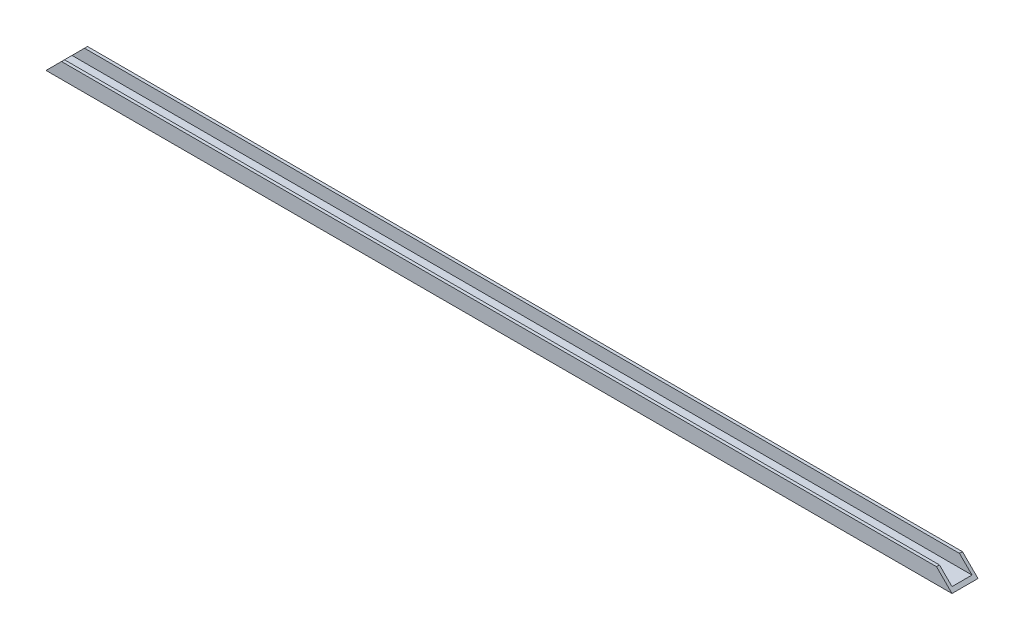
ISO-10303-21;
HEADER;
FILE_DESCRIPTION(('STEP AP214'),'2;1');
FILE_NAME('part.step','',(''),(''),'','','');
FILE_SCHEMA(('AUTOMOTIVE_DESIGN { 1 0 10303 214 1 1 1 1 }'));
ENDSEC;
DATA;
#1=APPLICATION_CONTEXT('core data for automotive mechanical design processes');
#2=APPLICATION_PROTOCOL_DEFINITION('international standard','automotive_design',2000,#1);
#3=PRODUCT_CONTEXT('',#1,'mechanical');
#4=PRODUCT('Part','Part','',(#3));
#5=PRODUCT_RELATED_PRODUCT_CATEGORY('part','',(#4));
#6=PRODUCT_DEFINITION_FORMATION('','',#4);
#7=PRODUCT_DEFINITION_CONTEXT('part definition',#1,'design');
#8=PRODUCT_DEFINITION('design','',#6,#7);
#9=PRODUCT_DEFINITION_SHAPE('','',#8);
#10=(LENGTH_UNIT() NAMED_UNIT(*) SI_UNIT(.MILLI.,.METRE.));
#11=(NAMED_UNIT(*) PLANE_ANGLE_UNIT() SI_UNIT($,.RADIAN.));
#12=(NAMED_UNIT(*) SI_UNIT($,.STERADIAN.) SOLID_ANGLE_UNIT());
#13=UNCERTAINTY_MEASURE_WITH_UNIT(LENGTH_MEASURE(1.E-05),#10,'distance_accuracy_value','');
#14=(GEOMETRIC_REPRESENTATION_CONTEXT(3) GLOBAL_UNCERTAINTY_ASSIGNED_CONTEXT((#13)) GLOBAL_UNIT_ASSIGNED_CONTEXT((#10,
#11,#12)) REPRESENTATION_CONTEXT('',''));
#15=CARTESIAN_POINT('',(0.,0.,0.));
#16=DIRECTION('',(0.,0.,1.));
#17=DIRECTION('',(1.,0.,0.));
#18=AXIS2_PLACEMENT_3D('',#15,#16,#17);
#19=CARTESIAN_POINT('',(181.2,5.,5.2));
#20=DIRECTION('',(0.,-1.,0.));
#21=DIRECTION('',(0.,0.,-1.));
#22=AXIS2_PLACEMENT_3D('',#19,#20,#21);
#23=PLANE('',#22);
#24=DIRECTION('',(-1.,0.,0.));
#25=VECTOR('',#24,1.);
#26=CARTESIAN_POINT('',(181.2,5.,4.));
#27=LINE('',#26,#25);
#28=CARTESIAN_POINT('',(175.,5.00000000000004,4.));
#29=VERTEX_POINT('',#28);
#30=CARTESIAN_POINT('',(-175.,5.,4.));
#31=VERTEX_POINT('',#30);
#32=EDGE_CURVE('E163',#29,#31,#27,.T.);
#33=ORIENTED_EDGE('',*,*,#32,.T.);
#34=DIRECTION('',(0.,0.,1.));
#35=VECTOR('',#34,1.);
#36=CARTESIAN_POINT('',(-175.,5.,-5.2));
#37=LINE('',#36,#35);
#38=CARTESIAN_POINT('',(-175.,5.,5.2));
#39=VERTEX_POINT('',#38);
#40=EDGE_CURVE('E108',#31,#39,#37,.T.);
#41=ORIENTED_EDGE('',*,*,#40,.T.);
#42=DIRECTION('',(-1.,0.,0.));
#43=VECTOR('',#42,1.);
#44=CARTESIAN_POINT('',(181.2,5.,5.2));
#45=LINE('',#44,#43);
#46=CARTESIAN_POINT('',(175.,5.00000000000004,5.2));
#47=VERTEX_POINT('',#46);
#48=EDGE_CURVE('E11',#47,#39,#45,.T.);
#49=ORIENTED_EDGE('',*,*,#48,.F.);
#50=DIRECTION('',(0.,0.,1.));
#51=VECTOR('',#50,1.);
#52=CARTESIAN_POINT('',(175.,5.00000000000004,-5.2));
#53=LINE('',#52,#51);
#54=EDGE_CURVE('E144',#29,#47,#53,.T.);
#55=ORIENTED_EDGE('',*,*,#54,.F.);
#56=EDGE_LOOP('',(#33,#41,#49,#55));
#57=FACE_BOUND('',#56,.T.);
#58=ADVANCED_FACE('F37',(#57),#23,.F.);
#59=CARTESIAN_POINT('',(181.2,5.,5.2));
#60=DIRECTION('',(0.,0.,-1.));
#61=DIRECTION('',(0.,1.,0.));
#62=AXIS2_PLACEMENT_3D('',#59,#60,#61);
#63=PLANE('',#62);
#64=ORIENTED_EDGE('',*,*,#48,.T.);
#65=DIRECTION('',(0.70710678118654,0.707106781186555,0.));
#66=VECTOR('',#65,1.);
#67=CARTESIAN_POINT('',(-181.2,-1.2,5.2));
#68=LINE('',#67,#66);
#69=CARTESIAN_POINT('',(-181.2,-1.2,5.2));
#70=VERTEX_POINT('',#69);
#71=EDGE_CURVE('E118',#70,#39,#68,.T.);
#72=ORIENTED_EDGE('',*,*,#71,.F.);
#73=DIRECTION('',(-1.,0.,0.));
#74=VECTOR('',#73,1.);
#75=CARTESIAN_POINT('',(181.2,-1.2,5.2));
#76=LINE('',#75,#74);
#77=CARTESIAN_POINT('',(181.2,-1.2,5.2));
#78=VERTEX_POINT('',#77);
#79=EDGE_CURVE('E45',#78,#70,#76,.T.);
#80=ORIENTED_EDGE('',*,*,#79,.F.);
#81=DIRECTION('',(0.70710678118654,-0.707106781186555,0.));
#82=VECTOR('',#81,1.);
#83=CARTESIAN_POINT('',(181.2,-1.19999999999996,5.2));
#84=LINE('',#83,#82);
#85=EDGE_CURVE('E51',#47,#78,#84,.T.);
#86=ORIENTED_EDGE('',*,*,#85,.F.);
#87=EDGE_LOOP('',(#64,#72,#80,#86));
#88=FACE_BOUND('',#87,.T.);
#89=ADVANCED_FACE('F137',(#88),#63,.F.);
#90=CARTESIAN_POINT('',(181.2,-1.2,5.2));
#91=DIRECTION('',(0.,1.,0.));
#92=DIRECTION('',(0.,0.,1.));
#93=AXIS2_PLACEMENT_3D('',#90,#91,#92);
#94=PLANE('',#93);
#95=DIRECTION('',(0.,0.,-1.));
#96=VECTOR('',#95,1.);
#97=CARTESIAN_POINT('',(-181.2,-1.2,5.2));
#98=LINE('',#97,#96);
#99=CARTESIAN_POINT('',(-181.2,-1.2,-5.2));
#100=VERTEX_POINT('',#99);
#101=EDGE_CURVE('E133',#70,#100,#98,.T.);
#102=ORIENTED_EDGE('',*,*,#101,.T.);
#103=DIRECTION('',(-1.,0.,0.));
#104=VECTOR('',#103,1.);
#105=CARTESIAN_POINT('',(181.2,-1.2,-5.2));
#106=LINE('',#105,#104);
#107=CARTESIAN_POINT('',(181.2,-1.19999999999996,-5.2));
#108=VERTEX_POINT('',#107);
#109=EDGE_CURVE('E117',#108,#100,#106,.T.);
#110=ORIENTED_EDGE('',*,*,#109,.F.);
#111=DIRECTION('',(0.,0.,-1.));
#112=VECTOR('',#111,1.);
#113=CARTESIAN_POINT('',(181.2,-1.2,5.2));
#114=LINE('',#113,#112);
#115=EDGE_CURVE('E134',#78,#108,#114,.T.);
#116=ORIENTED_EDGE('',*,*,#115,.F.);
#117=ORIENTED_EDGE('',*,*,#79,.T.);
#118=EDGE_LOOP('',(#102,#110,#116,#117));
#119=FACE_BOUND('',#118,.T.);
#120=ADVANCED_FACE('F132',(#119),#94,.F.);
#121=CARTESIAN_POINT('',(181.2,-1.2,-5.2));
#122=DIRECTION('',(0.,0.,1.));
#123=DIRECTION('',(1.,0.,0.));
#124=AXIS2_PLACEMENT_3D('',#121,#122,#123);
#125=PLANE('',#124);
#126=ORIENTED_EDGE('',*,*,#109,.T.);
#127=DIRECTION('',(0.70710678118654,0.707106781186555,0.));
#128=VECTOR('',#127,1.);
#129=CARTESIAN_POINT('',(-181.2,-1.2,-5.2));
#130=LINE('',#129,#128);
#131=CARTESIAN_POINT('',(-175.,5.,-5.2));
#132=VERTEX_POINT('',#131);
#133=EDGE_CURVE('E99',#100,#132,#130,.T.);
#134=ORIENTED_EDGE('',*,*,#133,.T.);
#135=DIRECTION('',(-1.,0.,0.));
#136=VECTOR('',#135,1.);
#137=CARTESIAN_POINT('',(181.2,5.,-5.2));
#138=LINE('',#137,#136);
#139=CARTESIAN_POINT('',(175.,5.00000000000004,-5.2));
#140=VERTEX_POINT('',#139);
#141=EDGE_CURVE('E115',#140,#132,#138,.T.);
#142=ORIENTED_EDGE('',*,*,#141,.F.);
#143=DIRECTION('',(0.70710678118654,-0.707106781186555,0.));
#144=VECTOR('',#143,1.);
#145=CARTESIAN_POINT('',(181.2,-1.19999999999996,-5.2));
#146=LINE('',#145,#144);
#147=EDGE_CURVE('E141',#140,#108,#146,.T.);
#148=ORIENTED_EDGE('',*,*,#147,.T.);
#149=EDGE_LOOP('',(#126,#134,#142,#148));
#150=FACE_BOUND('',#149,.T.);
#151=ADVANCED_FACE('F113',(#150),#125,.F.);
#152=CARTESIAN_POINT('',(181.2,5.,-4.));
#153=DIRECTION('',(0.,-1.,0.));
#154=DIRECTION('',(0.,0.,-1.));
#155=AXIS2_PLACEMENT_3D('',#152,#153,#154);
#156=PLANE('',#155);
#157=ORIENTED_EDGE('',*,*,#141,.T.);
#158=CARTESIAN_POINT('',(-175.,5.,-4.));
#159=VERTEX_POINT('',#158);
#160=EDGE_CURVE('E96',#132,#159,#37,.T.);
#161=ORIENTED_EDGE('',*,*,#160,.T.);
#162=DIRECTION('',(-1.,0.,0.));
#163=VECTOR('',#162,1.);
#164=CARTESIAN_POINT('',(181.2,5.,-4.));
#165=LINE('',#164,#163);
#166=CARTESIAN_POINT('',(175.,5.00000000000004,-4.));
#167=VERTEX_POINT('',#166);
#168=EDGE_CURVE('E123',#167,#159,#165,.T.);
#169=ORIENTED_EDGE('',*,*,#168,.F.);
#170=EDGE_CURVE('E122',#140,#167,#53,.T.);
#171=ORIENTED_EDGE('',*,*,#170,.F.);
#172=EDGE_LOOP('',(#157,#161,#169,#171));
#173=FACE_BOUND('',#172,.T.);
#174=ADVANCED_FACE('F121',(#173),#156,.F.);
#175=CARTESIAN_POINT('',(181.2,0.,-4.));
#176=DIRECTION('',(0.,0.,-1.));
#177=DIRECTION('',(-1.,0.,0.));
#178=AXIS2_PLACEMENT_3D('',#175,#176,#177);
#179=PLANE('',#178);
#180=ORIENTED_EDGE('',*,*,#168,.T.);
#181=DIRECTION('',(-0.70710678118654,-0.707106781186555,0.));
#182=VECTOR('',#181,1.);
#183=CARTESIAN_POINT('',(0.599999999996298,180.6,-4.));
#184=LINE('',#183,#182);
#185=CARTESIAN_POINT('',(-180.,0.,-4.));
#186=VERTEX_POINT('',#185);
#187=EDGE_CURVE('E102',#159,#186,#184,.T.);
#188=ORIENTED_EDGE('',*,*,#187,.T.);
#189=DIRECTION('',(-1.,0.,0.));
#190=VECTOR('',#189,1.);
#191=CARTESIAN_POINT('',(181.2,0.,-4.));
#192=LINE('',#191,#190);
#193=CARTESIAN_POINT('',(180.,0.,-4.));
#194=VERTEX_POINT('',#193);
#195=EDGE_CURVE('E126',#194,#186,#192,.T.);
#196=ORIENTED_EDGE('',*,*,#195,.F.);
#197=DIRECTION('',(-0.70710678118654,0.707106781186555,0.));
#198=VECTOR('',#197,1.);
#199=CARTESIAN_POINT('',(180.6,-0.599999999999965,-4.));
#200=LINE('',#199,#198);
#201=EDGE_CURVE('E159',#194,#167,#200,.T.);
#202=ORIENTED_EDGE('',*,*,#201,.T.);
#203=EDGE_LOOP('',(#180,#188,#196,#202));
#204=FACE_BOUND('',#203,.T.);
#205=ADVANCED_FACE('F175',(#204),#179,.F.);
#206=CARTESIAN_POINT('',(181.2,0.,4.));
#207=DIRECTION('',(0.,-1.,0.));
#208=DIRECTION('',(0.,0.,-1.));
#209=AXIS2_PLACEMENT_3D('',#206,#207,#208);
#210=PLANE('',#209);
#211=ORIENTED_EDGE('',*,*,#195,.T.);
#212=DIRECTION('',(0.,0.,1.));
#213=VECTOR('',#212,1.);
#214=CARTESIAN_POINT('',(-180.,0.,3.99999999999993));
#215=LINE('',#214,#213);
#216=CARTESIAN_POINT('',(-180.,0.,4.));
#217=VERTEX_POINT('',#216);
#218=EDGE_CURVE('E149',#186,#217,#215,.T.);
#219=ORIENTED_EDGE('',*,*,#218,.T.);
#220=DIRECTION('',(-1.,0.,0.));
#221=VECTOR('',#220,1.);
#222=CARTESIAN_POINT('',(181.2,0.,4.));
#223=LINE('',#222,#221);
#224=CARTESIAN_POINT('',(180.,0.,4.));
#225=VERTEX_POINT('',#224);
#226=EDGE_CURVE('E167',#225,#217,#223,.T.);
#227=ORIENTED_EDGE('',*,*,#226,.F.);
#228=DIRECTION('',(0.,0.,-1.));
#229=VECTOR('',#228,1.);
#230=CARTESIAN_POINT('',(180.,0.,4.));
#231=LINE('',#230,#229);
#232=EDGE_CURVE('E156',#225,#194,#231,.T.);
#233=ORIENTED_EDGE('',*,*,#232,.T.);
#234=EDGE_LOOP('',(#211,#219,#227,#233));
#235=FACE_BOUND('',#234,.T.);
#236=ADVANCED_FACE('F172',(#235),#210,.F.);
#237=CARTESIAN_POINT('',(181.2,5.,4.));
#238=DIRECTION('',(0.,0.,1.));
#239=DIRECTION('',(1.,0.,0.));
#240=AXIS2_PLACEMENT_3D('',#237,#238,#239);
#241=PLANE('',#240);
#242=ORIENTED_EDGE('',*,*,#226,.T.);
#243=DIRECTION('',(0.70710678118654,0.707106781186555,0.));
#244=VECTOR('',#243,1.);
#245=CARTESIAN_POINT('',(3.0999999999963,183.1,4.));
#246=LINE('',#245,#244);
#247=EDGE_CURVE('E107',#217,#31,#246,.T.);
#248=ORIENTED_EDGE('',*,*,#247,.T.);
#249=ORIENTED_EDGE('',*,*,#32,.F.);
#250=DIRECTION('',(0.70710678118654,-0.707106781186555,0.));
#251=VECTOR('',#250,1.);
#252=CARTESIAN_POINT('',(178.1,1.90000000000008,4.));
#253=LINE('',#252,#251);
#254=EDGE_CURVE('E153',#29,#225,#253,.T.);
#255=ORIENTED_EDGE('',*,*,#254,.T.);
#256=EDGE_LOOP('',(#242,#248,#249,#255));
#257=FACE_BOUND('',#256,.T.);
#258=ADVANCED_FACE('F180',(#257),#241,.F.);
#259=CARTESIAN_POINT('',(-181.2,-1.2,-5.2));
#260=DIRECTION('',(0.707106781186555,-0.70710678118654,0.));
#261=DIRECTION('',(0.70710678118654,0.707106781186555,0.));
#262=AXIS2_PLACEMENT_3D('',#259,#260,#261);
#263=PLANE('',#262);
#264=ORIENTED_EDGE('',*,*,#160,.F.);
#265=ORIENTED_EDGE('',*,*,#133,.F.);
#266=ORIENTED_EDGE('',*,*,#101,.F.);
#267=ORIENTED_EDGE('',*,*,#71,.T.);
#268=ORIENTED_EDGE('',*,*,#40,.F.);
#269=ORIENTED_EDGE('',*,*,#247,.F.);
#270=ORIENTED_EDGE('',*,*,#218,.F.);
#271=ORIENTED_EDGE('',*,*,#187,.F.);
#272=EDGE_LOOP('',(#264,#265,#266,#267,#268,#269,#270,#271));
#273=FACE_BOUND('',#272,.T.);
#274=ADVANCED_FACE('F98',(#273),#263,.F.);
#275=CARTESIAN_POINT('',(181.2,-1.19999999999996,-5.2));
#276=DIRECTION('',(-0.707106781186555,-0.70710678118654,0.));
#277=DIRECTION('',(0.70710678118654,-0.707106781186555,0.));
#278=AXIS2_PLACEMENT_3D('',#275,#276,#277);
#279=PLANE('',#278);
#280=ORIENTED_EDGE('',*,*,#232,.F.);
#281=ORIENTED_EDGE('',*,*,#254,.F.);
#282=ORIENTED_EDGE('',*,*,#54,.T.);
#283=ORIENTED_EDGE('',*,*,#85,.T.);
#284=ORIENTED_EDGE('',*,*,#115,.T.);
#285=ORIENTED_EDGE('',*,*,#147,.F.);
#286=ORIENTED_EDGE('',*,*,#170,.T.);
#287=ORIENTED_EDGE('',*,*,#201,.F.);
#288=EDGE_LOOP('',(#280,#281,#282,#283,#284,#285,#286,#287));
#289=FACE_BOUND('',#288,.T.);
#290=ADVANCED_FACE('F176',(#289),#279,.F.);
#291=CLOSED_SHELL('',(#58,#89,#120,#151,#174,#205,#236,#258,#274,#290));
#292=MANIFOLD_SOLID_BREP('B2',#291);
#293=ADVANCED_BREP_SHAPE_REPRESENTATION('',(#18,#292),#14);
#294=SHAPE_DEFINITION_REPRESENTATION(#9,#293);
ENDSEC;
END-ISO-10303-21;
